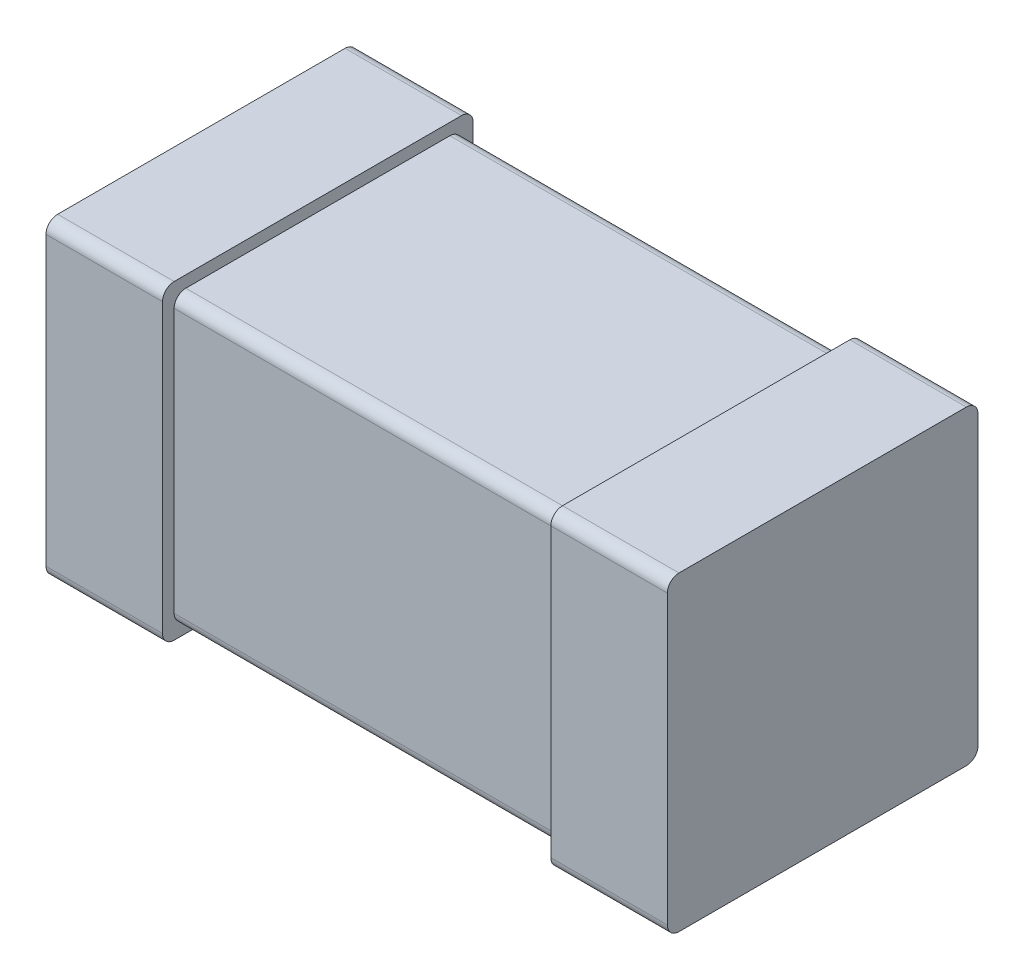
ISO-10303-21;
HEADER;
FILE_DESCRIPTION(('STEP AP214'),'2;1');
FILE_NAME('part.step','',(''),(''),'','','');
FILE_SCHEMA(('AUTOMOTIVE_DESIGN { 1 0 10303 214 1 1 1 1 }'));
ENDSEC;
DATA;
#1=APPLICATION_CONTEXT('core data for automotive mechanical design processes');
#2=APPLICATION_PROTOCOL_DEFINITION('international standard','automotive_design',2000,#1);
#3=PRODUCT_CONTEXT('',#1,'mechanical');
#4=PRODUCT('Part','Part','',(#3));
#5=PRODUCT_RELATED_PRODUCT_CATEGORY('part','',(#4));
#6=PRODUCT_DEFINITION_FORMATION('','',#4);
#7=PRODUCT_DEFINITION_CONTEXT('part definition',#1,'design');
#8=PRODUCT_DEFINITION('design','',#6,#7);
#9=PRODUCT_DEFINITION_SHAPE('','',#8);
#10=(LENGTH_UNIT() NAMED_UNIT(*) SI_UNIT(.MILLI.,.METRE.));
#11=(NAMED_UNIT(*) PLANE_ANGLE_UNIT() SI_UNIT($,.RADIAN.));
#12=(NAMED_UNIT(*) SI_UNIT($,.STERADIAN.) SOLID_ANGLE_UNIT());
#13=UNCERTAINTY_MEASURE_WITH_UNIT(LENGTH_MEASURE(1.E-05),#10,'distance_accuracy_value','');
#14=(GEOMETRIC_REPRESENTATION_CONTEXT(3) GLOBAL_UNCERTAINTY_ASSIGNED_CONTEXT((#13)) GLOBAL_UNIT_ASSIGNED_CONTEXT((#10,
#11,#12)) REPRESENTATION_CONTEXT('',''));
#15=CARTESIAN_POINT('',(0.,0.,0.));
#16=DIRECTION('',(0.,0.,1.));
#17=DIRECTION('',(1.,0.,0.));
#18=AXIS2_PLACEMENT_3D('',#15,#16,#17);
#19=CARTESIAN_POINT('',(-0.8,-0.4,0.));
#20=DIRECTION('',(1.,0.,0.));
#21=DIRECTION('',(0.,0.,-1.));
#22=AXIS2_PLACEMENT_3D('',#19,#20,#21);
#23=PLANE('',#22);
#24=DIRECTION('',(0.,1.,0.));
#25=VECTOR('',#24,1.);
#26=CARTESIAN_POINT('',(-0.8,-0.4,0.8));
#27=LINE('',#26,#25);
#28=CARTESIAN_POINT('',(-0.8,0.37,0.8));
#29=VERTEX_POINT('',#28);
#30=CARTESIAN_POINT('',(-0.8,-0.37,0.8));
#31=VERTEX_POINT('',#30);
#32=EDGE_CURVE('E300',#29,#31,#27,.F.);
#33=ORIENTED_EDGE('',*,*,#32,.F.);
#34=CARTESIAN_POINT('',(-0.8,0.37,0.77));
#35=DIRECTION('',(1.,0.,0.));
#36=DIRECTION('',(0.,0.,-1.));
#37=AXIS2_PLACEMENT_3D('',#34,#35,#36);
#38=CIRCLE('',#37,0.03);
#39=CARTESIAN_POINT('',(-0.8,0.4,0.77));
#40=VERTEX_POINT('',#39);
#41=EDGE_CURVE('E279',#40,#29,#38,.T.);
#42=ORIENTED_EDGE('',*,*,#41,.F.);
#43=DIRECTION('',(0.,0.,1.));
#44=VECTOR('',#43,1.);
#45=CARTESIAN_POINT('',(-0.8,0.4,0.));
#46=LINE('',#45,#44);
#47=CARTESIAN_POINT('',(-0.8,0.4,0.03));
#48=VERTEX_POINT('',#47);
#49=EDGE_CURVE('E201',#48,#40,#46,.T.);
#50=ORIENTED_EDGE('',*,*,#49,.F.);
#51=CARTESIAN_POINT('',(-0.8,0.37,0.03));
#52=DIRECTION('',(1.,0.,0.));
#53=DIRECTION('',(0.,0.,-1.));
#54=AXIS2_PLACEMENT_3D('',#51,#52,#53);
#55=CIRCLE('',#54,0.03);
#56=CARTESIAN_POINT('',(-0.8,0.37,0.));
#57=VERTEX_POINT('',#56);
#58=EDGE_CURVE('E196',#57,#48,#55,.T.);
#59=ORIENTED_EDGE('',*,*,#58,.F.);
#60=DIRECTION('',(0.,1.,0.));
#61=VECTOR('',#60,1.);
#62=CARTESIAN_POINT('',(-0.8,-0.4,0.));
#63=LINE('',#62,#61);
#64=CARTESIAN_POINT('',(-0.8,-0.37,0.));
#65=VERTEX_POINT('',#64);
#66=EDGE_CURVE('E188',#57,#65,#63,.F.);
#67=ORIENTED_EDGE('',*,*,#66,.T.);
#68=CARTESIAN_POINT('',(-0.8,-0.37,0.03));
#69=DIRECTION('',(1.,0.,0.));
#70=DIRECTION('',(0.,0.,-1.));
#71=AXIS2_PLACEMENT_3D('',#68,#69,#70);
#72=CIRCLE('',#71,0.03);
#73=CARTESIAN_POINT('',(-0.8,-0.4,0.03));
#74=VERTEX_POINT('',#73);
#75=EDGE_CURVE('E20',#74,#65,#72,.T.);
#76=ORIENTED_EDGE('',*,*,#75,.F.);
#77=DIRECTION('',(0.,0.,1.));
#78=VECTOR('',#77,1.);
#79=CARTESIAN_POINT('',(-0.8,-0.4,0.));
#80=LINE('',#79,#78);
#81=CARTESIAN_POINT('',(-0.8,-0.4,0.77));
#82=VERTEX_POINT('',#81);
#83=EDGE_CURVE('E171',#74,#82,#80,.T.);
#84=ORIENTED_EDGE('',*,*,#83,.T.);
#85=CARTESIAN_POINT('',(-0.8,-0.37,0.77));
#86=DIRECTION('',(1.,0.,0.));
#87=DIRECTION('',(0.,0.,-1.));
#88=AXIS2_PLACEMENT_3D('',#85,#86,#87);
#89=CIRCLE('',#88,0.03);
#90=EDGE_CURVE('E275',#31,#82,#89,.T.);
#91=ORIENTED_EDGE('',*,*,#90,.F.);
#92=EDGE_LOOP('',(#33,#42,#50,#59,#67,#76,#84,#91));
#93=FACE_BOUND('',#92,.T.);
#94=ADVANCED_FACE('F17',(#93),#23,.F.);
#95=CARTESIAN_POINT('',(0.8,-0.4,0.));
#96=DIRECTION('',(1.,0.,0.));
#97=DIRECTION('',(0.,0.,-1.));
#98=AXIS2_PLACEMENT_3D('',#95,#96,#97);
#99=PLANE('',#98);
#100=DIRECTION('',(0.,1.,0.));
#101=VECTOR('',#100,1.);
#102=CARTESIAN_POINT('',(0.8,-0.4,0.8));
#103=LINE('',#102,#101);
#104=CARTESIAN_POINT('',(0.8,-0.37,0.8));
#105=VERTEX_POINT('',#104);
#106=CARTESIAN_POINT('',(0.8,0.37,0.8));
#107=VERTEX_POINT('',#106);
#108=EDGE_CURVE('E290',#105,#107,#103,.T.);
#109=ORIENTED_EDGE('',*,*,#108,.F.);
#110=CARTESIAN_POINT('',(0.8,-0.37,0.77));
#111=DIRECTION('',(1.,0.,0.));
#112=DIRECTION('',(0.,0.,-1.));
#113=AXIS2_PLACEMENT_3D('',#110,#111,#112);
#114=CIRCLE('',#113,0.03);
#115=CARTESIAN_POINT('',(0.8,-0.4,0.77));
#116=VERTEX_POINT('',#115);
#117=EDGE_CURVE('E259',#116,#105,#114,.F.);
#118=ORIENTED_EDGE('',*,*,#117,.F.);
#119=DIRECTION('',(0.,0.,1.));
#120=VECTOR('',#119,1.);
#121=CARTESIAN_POINT('',(0.8,-0.4,0.));
#122=LINE('',#121,#120);
#123=CARTESIAN_POINT('',(0.8,-0.4,0.03));
#124=VERTEX_POINT('',#123);
#125=EDGE_CURVE('E274',#116,#124,#122,.F.);
#126=ORIENTED_EDGE('',*,*,#125,.T.);
#127=CARTESIAN_POINT('',(0.8,-0.37,0.03));
#128=DIRECTION('',(1.,0.,0.));
#129=DIRECTION('',(0.,0.,-1.));
#130=AXIS2_PLACEMENT_3D('',#127,#128,#129);
#131=CIRCLE('',#130,0.03);
#132=CARTESIAN_POINT('',(0.8,-0.37,0.));
#133=VERTEX_POINT('',#132);
#134=EDGE_CURVE('E271',#133,#124,#131,.F.);
#135=ORIENTED_EDGE('',*,*,#134,.F.);
#136=DIRECTION('',(0.,1.,0.));
#137=VECTOR('',#136,1.);
#138=CARTESIAN_POINT('',(0.8,-0.4,0.));
#139=LINE('',#138,#137);
#140=CARTESIAN_POINT('',(0.8,0.37,0.));
#141=VERTEX_POINT('',#140);
#142=EDGE_CURVE('E270',#133,#141,#139,.T.);
#143=ORIENTED_EDGE('',*,*,#142,.T.);
#144=CARTESIAN_POINT('',(0.8,0.37,0.03));
#145=DIRECTION('',(1.,0.,0.));
#146=DIRECTION('',(0.,0.,-1.));
#147=AXIS2_PLACEMENT_3D('',#144,#145,#146);
#148=CIRCLE('',#147,0.03);
#149=CARTESIAN_POINT('',(0.8,0.4,0.03));
#150=VERTEX_POINT('',#149);
#151=EDGE_CURVE('E267',#150,#141,#148,.F.);
#152=ORIENTED_EDGE('',*,*,#151,.F.);
#153=DIRECTION('',(0.,0.,1.));
#154=VECTOR('',#153,1.);
#155=CARTESIAN_POINT('',(0.8,0.4,0.));
#156=LINE('',#155,#154);
#157=CARTESIAN_POINT('',(0.8,0.4,0.77));
#158=VERTEX_POINT('',#157);
#159=EDGE_CURVE('E295',#158,#150,#156,.F.);
#160=ORIENTED_EDGE('',*,*,#159,.F.);
#161=CARTESIAN_POINT('',(0.8,0.37,0.77));
#162=DIRECTION('',(1.,0.,0.));
#163=DIRECTION('',(0.,0.,-1.));
#164=AXIS2_PLACEMENT_3D('',#161,#162,#163);
#165=CIRCLE('',#164,0.03);
#166=EDGE_CURVE('E263',#107,#158,#165,.F.);
#167=ORIENTED_EDGE('',*,*,#166,.F.);
#168=EDGE_LOOP('',(#109,#118,#126,#135,#143,#152,#160,#167));
#169=FACE_BOUND('',#168,.T.);
#170=ADVANCED_FACE('F444',(#169),#99,.T.);
#171=CARTESIAN_POINT('',(-0.8,-0.4,0.));
#172=DIRECTION('',(0.,1.,0.));
#173=DIRECTION('',(0.,0.,1.));
#174=AXIS2_PLACEMENT_3D('',#171,#172,#173);
#175=PLANE('',#174);
#176=ORIENTED_EDGE('',*,*,#83,.F.);
#177=DIRECTION('',(1.,0.,0.));
#178=VECTOR('',#177,1.);
#179=CARTESIAN_POINT('',(-0.8,-0.4,0.03));
#180=LINE('',#179,#178);
#181=CARTESIAN_POINT('',(-0.5,-0.4,0.03));
#182=VERTEX_POINT('',#181);
#183=EDGE_CURVE('E182',#182,#74,#180,.F.);
#184=ORIENTED_EDGE('',*,*,#183,.F.);
#185=DIRECTION('',(0.,0.,-1.));
#186=VECTOR('',#185,1.);
#187=CARTESIAN_POINT('',(-0.5,-0.4,0.));
#188=LINE('',#187,#186);
#189=CARTESIAN_POINT('',(-0.5,-0.4,0.77));
#190=VERTEX_POINT('',#189);
#191=EDGE_CURVE('E258',#190,#182,#188,.T.);
#192=ORIENTED_EDGE('',*,*,#191,.F.);
#193=DIRECTION('',(1.,0.,0.));
#194=VECTOR('',#193,1.);
#195=CARTESIAN_POINT('',(-0.8,-0.4,0.77));
#196=LINE('',#195,#194);
#197=EDGE_CURVE('E307',#82,#190,#196,.T.);
#198=ORIENTED_EDGE('',*,*,#197,.F.);
#199=EDGE_LOOP('',(#176,#184,#192,#198));
#200=FACE_BOUND('',#199,.T.);
#201=ADVANCED_FACE('F310',(#200),#175,.F.);
#202=CARTESIAN_POINT('',(-0.8,-0.37,0.03));
#203=DIRECTION('',(1.,0.,0.));
#204=DIRECTION('',(0.,0.,-1.));
#205=AXIS2_PLACEMENT_3D('',#202,#203,#204);
#206=CYLINDRICAL_SURFACE('',#205,0.03);
#207=CARTESIAN_POINT('',(-0.5,-0.37,0.03));
#208=DIRECTION('',(1.,0.,0.));
#209=DIRECTION('',(0.,0.,-1.));
#210=AXIS2_PLACEMENT_3D('',#207,#208,#209);
#211=CIRCLE('',#210,0.03);
#212=CARTESIAN_POINT('',(-0.5,-0.37,0.));
#213=VERTEX_POINT('',#212);
#214=EDGE_CURVE('E256',#182,#213,#211,.T.);
#215=ORIENTED_EDGE('',*,*,#214,.F.);
#216=ORIENTED_EDGE('',*,*,#183,.T.);
#217=ORIENTED_EDGE('',*,*,#75,.T.);
#218=DIRECTION('',(1.,0.,0.));
#219=VECTOR('',#218,1.);
#220=CARTESIAN_POINT('',(-0.8,-0.37,0.));
#221=LINE('',#220,#219);
#222=EDGE_CURVE('E180',#65,#213,#221,.T.);
#223=ORIENTED_EDGE('',*,*,#222,.T.);
#224=EDGE_LOOP('',(#215,#216,#217,#223));
#225=FACE_BOUND('',#224,.T.);
#226=ADVANCED_FACE('F179',(#225),#206,.T.);
#227=CARTESIAN_POINT('',(-0.8,-0.4,0.));
#228=DIRECTION('',(0.,0.,1.));
#229=DIRECTION('',(1.,0.,0.));
#230=AXIS2_PLACEMENT_3D('',#227,#228,#229);
#231=PLANE('',#230);
#232=DIRECTION('',(0.,1.,0.));
#233=VECTOR('',#232,1.);
#234=CARTESIAN_POINT('',(-0.5,-0.4,0.));
#235=LINE('',#234,#233);
#236=CARTESIAN_POINT('',(-0.5,0.37,0.));
#237=VERTEX_POINT('',#236);
#238=EDGE_CURVE('E190',#213,#237,#235,.T.);
#239=ORIENTED_EDGE('',*,*,#238,.F.);
#240=ORIENTED_EDGE('',*,*,#222,.F.);
#241=ORIENTED_EDGE('',*,*,#66,.F.);
#242=DIRECTION('',(1.,0.,0.));
#243=VECTOR('',#242,1.);
#244=CARTESIAN_POINT('',(-0.8,0.37,0.));
#245=LINE('',#244,#243);
#246=EDGE_CURVE('E191',#237,#57,#245,.F.);
#247=ORIENTED_EDGE('',*,*,#246,.F.);
#248=EDGE_LOOP('',(#239,#240,#241,#247));
#249=FACE_BOUND('',#248,.T.);
#250=ADVANCED_FACE('F186',(#249),#231,.F.);
#251=CARTESIAN_POINT('',(-0.8,0.37,0.03));
#252=DIRECTION('',(1.,0.,0.));
#253=DIRECTION('',(0.,0.,-1.));
#254=AXIS2_PLACEMENT_3D('',#251,#252,#253);
#255=CYLINDRICAL_SURFACE('',#254,0.03);
#256=ORIENTED_EDGE('',*,*,#246,.T.);
#257=ORIENTED_EDGE('',*,*,#58,.T.);
#258=DIRECTION('',(1.,0.,0.));
#259=VECTOR('',#258,1.);
#260=CARTESIAN_POINT('',(-0.8,0.4,0.03));
#261=LINE('',#260,#259);
#262=CARTESIAN_POINT('',(-0.5,0.4,0.03));
#263=VERTEX_POINT('',#262);
#264=EDGE_CURVE('E281',#263,#48,#261,.F.);
#265=ORIENTED_EDGE('',*,*,#264,.F.);
#266=CARTESIAN_POINT('',(-0.5,0.37,0.03));
#267=DIRECTION('',(1.,0.,0.));
#268=DIRECTION('',(0.,0.,-1.));
#269=AXIS2_PLACEMENT_3D('',#266,#267,#268);
#270=CIRCLE('',#269,0.03);
#271=EDGE_CURVE('E254',#237,#263,#270,.T.);
#272=ORIENTED_EDGE('',*,*,#271,.F.);
#273=EDGE_LOOP('',(#256,#257,#265,#272));
#274=FACE_BOUND('',#273,.T.);
#275=ADVANCED_FACE('F674',(#274),#255,.T.);
#276=CARTESIAN_POINT('',(-0.8,0.4,0.));
#277=DIRECTION('',(0.,1.,0.));
#278=DIRECTION('',(0.,0.,1.));
#279=AXIS2_PLACEMENT_3D('',#276,#277,#278);
#280=PLANE('',#279);
#281=ORIENTED_EDGE('',*,*,#49,.T.);
#282=DIRECTION('',(1.,0.,0.));
#283=VECTOR('',#282,1.);
#284=CARTESIAN_POINT('',(-0.8,0.4,0.77));
#285=LINE('',#284,#283);
#286=CARTESIAN_POINT('',(-0.5,0.4,0.77));
#287=VERTEX_POINT('',#286);
#288=EDGE_CURVE('E280',#287,#40,#285,.F.);
#289=ORIENTED_EDGE('',*,*,#288,.F.);
#290=DIRECTION('',(0.,0.,-1.));
#291=VECTOR('',#290,1.);
#292=CARTESIAN_POINT('',(-0.5,0.4,0.));
#293=LINE('',#292,#291);
#294=EDGE_CURVE('E253',#263,#287,#293,.F.);
#295=ORIENTED_EDGE('',*,*,#294,.F.);
#296=ORIENTED_EDGE('',*,*,#264,.T.);
#297=EDGE_LOOP('',(#281,#289,#295,#296));
#298=FACE_BOUND('',#297,.T.);
#299=ADVANCED_FACE('F666',(#298),#280,.T.);
#300=CARTESIAN_POINT('',(-0.8,0.37,0.77));
#301=DIRECTION('',(1.,0.,0.));
#302=DIRECTION('',(0.,0.,-1.));
#303=AXIS2_PLACEMENT_3D('',#300,#301,#302);
#304=CYLINDRICAL_SURFACE('',#303,0.03);
#305=CARTESIAN_POINT('',(-0.5,0.37,0.77));
#306=DIRECTION('',(1.,0.,0.));
#307=DIRECTION('',(0.,0.,-1.));
#308=AXIS2_PLACEMENT_3D('',#305,#306,#307);
#309=CIRCLE('',#308,0.03);
#310=CARTESIAN_POINT('',(-0.5,0.37,0.8));
#311=VERTEX_POINT('',#310);
#312=EDGE_CURVE('E251',#287,#311,#309,.T.);
#313=ORIENTED_EDGE('',*,*,#312,.F.);
#314=ORIENTED_EDGE('',*,*,#288,.T.);
#315=ORIENTED_EDGE('',*,*,#41,.T.);
#316=DIRECTION('',(1.,0.,0.));
#317=VECTOR('',#316,1.);
#318=CARTESIAN_POINT('',(-0.8,0.37,0.8));
#319=LINE('',#318,#317);
#320=EDGE_CURVE('E301',#311,#29,#319,.F.);
#321=ORIENTED_EDGE('',*,*,#320,.F.);
#322=EDGE_LOOP('',(#313,#314,#315,#321));
#323=FACE_BOUND('',#322,.T.);
#324=ADVANCED_FACE('F322',(#323),#304,.T.);
#325=CARTESIAN_POINT('',(-0.8,-0.4,0.8));
#326=DIRECTION('',(0.,0.,1.));
#327=DIRECTION('',(1.,0.,0.));
#328=AXIS2_PLACEMENT_3D('',#325,#326,#327);
#329=PLANE('',#328);
#330=DIRECTION('',(0.,1.,0.));
#331=VECTOR('',#330,1.);
#332=CARTESIAN_POINT('',(-0.5,-0.4,0.8));
#333=LINE('',#332,#331);
#334=CARTESIAN_POINT('',(-0.5,-0.37,0.8));
#335=VERTEX_POINT('',#334);
#336=EDGE_CURVE('E250',#311,#335,#333,.F.);
#337=ORIENTED_EDGE('',*,*,#336,.F.);
#338=ORIENTED_EDGE('',*,*,#320,.T.);
#339=ORIENTED_EDGE('',*,*,#32,.T.);
#340=DIRECTION('',(1.,0.,0.));
#341=VECTOR('',#340,1.);
#342=CARTESIAN_POINT('',(-0.8,-0.37,0.8));
#343=LINE('',#342,#341);
#344=EDGE_CURVE('E278',#335,#31,#343,.F.);
#345=ORIENTED_EDGE('',*,*,#344,.F.);
#346=EDGE_LOOP('',(#337,#338,#339,#345));
#347=FACE_BOUND('',#346,.T.);
#348=ADVANCED_FACE('F328',(#347),#329,.T.);
#349=CARTESIAN_POINT('',(-0.8,-0.37,0.77));
#350=DIRECTION('',(1.,0.,0.));
#351=DIRECTION('',(0.,0.,-1.));
#352=AXIS2_PLACEMENT_3D('',#349,#350,#351);
#353=CYLINDRICAL_SURFACE('',#352,0.03);
#354=ORIENTED_EDGE('',*,*,#344,.T.);
#355=ORIENTED_EDGE('',*,*,#90,.T.);
#356=ORIENTED_EDGE('',*,*,#197,.T.);
#357=CARTESIAN_POINT('',(-0.5,-0.37,0.77));
#358=DIRECTION('',(1.,0.,0.));
#359=DIRECTION('',(0.,0.,-1.));
#360=AXIS2_PLACEMENT_3D('',#357,#358,#359);
#361=CIRCLE('',#360,0.03);
#362=EDGE_CURVE('E247',#335,#190,#361,.T.);
#363=ORIENTED_EDGE('',*,*,#362,.F.);
#364=EDGE_LOOP('',(#354,#355,#356,#363));
#365=FACE_BOUND('',#364,.T.);
#366=ADVANCED_FACE('F305',(#365),#353,.T.);
#367=CARTESIAN_POINT('',(0.5,-0.4,0.));
#368=DIRECTION('',(0.,1.,0.));
#369=DIRECTION('',(0.,0.,1.));
#370=AXIS2_PLACEMENT_3D('',#367,#368,#369);
#371=PLANE('',#370);
#372=DIRECTION('',(0.,0.,-1.));
#373=VECTOR('',#372,1.);
#374=CARTESIAN_POINT('',(0.5,-0.4,0.));
#375=LINE('',#374,#373);
#376=CARTESIAN_POINT('',(0.5,-0.4,0.77));
#377=VERTEX_POINT('',#376);
#378=CARTESIAN_POINT('',(0.5,-0.4,0.03));
#379=VERTEX_POINT('',#378);
#380=EDGE_CURVE('E236',#377,#379,#375,.T.);
#381=ORIENTED_EDGE('',*,*,#380,.T.);
#382=DIRECTION('',(1.,0.,0.));
#383=VECTOR('',#382,1.);
#384=CARTESIAN_POINT('',(0.5,-0.4,0.03));
#385=LINE('',#384,#383);
#386=EDGE_CURVE('E273',#124,#379,#385,.F.);
#387=ORIENTED_EDGE('',*,*,#386,.F.);
#388=ORIENTED_EDGE('',*,*,#125,.F.);
#389=DIRECTION('',(1.,0.,0.));
#390=VECTOR('',#389,1.);
#391=CARTESIAN_POINT('',(0.5,-0.4,0.77));
#392=LINE('',#391,#390);
#393=EDGE_CURVE('E262',#377,#116,#392,.T.);
#394=ORIENTED_EDGE('',*,*,#393,.F.);
#395=EDGE_LOOP('',(#381,#387,#388,#394));
#396=FACE_BOUND('',#395,.T.);
#397=ADVANCED_FACE('F369',(#396),#371,.F.);
#398=CARTESIAN_POINT('',(0.5,-0.37,0.03));
#399=DIRECTION('',(1.,0.,0.));
#400=DIRECTION('',(0.,0.,-1.));
#401=AXIS2_PLACEMENT_3D('',#398,#399,#400);
#402=CYLINDRICAL_SURFACE('',#401,0.03);
#403=ORIENTED_EDGE('',*,*,#134,.T.);
#404=ORIENTED_EDGE('',*,*,#386,.T.);
#405=CARTESIAN_POINT('',(0.5,-0.37,0.03));
#406=DIRECTION('',(1.,0.,0.));
#407=DIRECTION('',(0.,0.,-1.));
#408=AXIS2_PLACEMENT_3D('',#405,#406,#407);
#409=CIRCLE('',#408,0.03);
#410=CARTESIAN_POINT('',(0.5,-0.37,0.));
#411=VERTEX_POINT('',#410);
#412=EDGE_CURVE('E233',#379,#411,#409,.T.);
#413=ORIENTED_EDGE('',*,*,#412,.T.);
#414=DIRECTION('',(1.,0.,0.));
#415=VECTOR('',#414,1.);
#416=CARTESIAN_POINT('',(0.5,-0.37,0.));
#417=LINE('',#416,#415);
#418=EDGE_CURVE('E299',#411,#133,#417,.T.);
#419=ORIENTED_EDGE('',*,*,#418,.T.);
#420=EDGE_LOOP('',(#403,#404,#413,#419));
#421=FACE_BOUND('',#420,.T.);
#422=ADVANCED_FACE('F358',(#421),#402,.T.);
#423=CARTESIAN_POINT('',(0.5,-0.4,0.));
#424=DIRECTION('',(0.,0.,1.));
#425=DIRECTION('',(1.,0.,0.));
#426=AXIS2_PLACEMENT_3D('',#423,#424,#425);
#427=PLANE('',#426);
#428=ORIENTED_EDGE('',*,*,#142,.F.);
#429=ORIENTED_EDGE('',*,*,#418,.F.);
#430=DIRECTION('',(0.,1.,0.));
#431=VECTOR('',#430,1.);
#432=CARTESIAN_POINT('',(0.5,-0.4,0.));
#433=LINE('',#432,#431);
#434=CARTESIAN_POINT('',(0.5,0.37,0.));
#435=VERTEX_POINT('',#434);
#436=EDGE_CURVE('E232',#411,#435,#433,.T.);
#437=ORIENTED_EDGE('',*,*,#436,.T.);
#438=DIRECTION('',(1.,0.,0.));
#439=VECTOR('',#438,1.);
#440=CARTESIAN_POINT('',(0.5,0.37,0.));
#441=LINE('',#440,#439);
#442=EDGE_CURVE('E269',#141,#435,#441,.F.);
#443=ORIENTED_EDGE('',*,*,#442,.F.);
#444=EDGE_LOOP('',(#428,#429,#437,#443));
#445=FACE_BOUND('',#444,.T.);
#446=ADVANCED_FACE('F441',(#445),#427,.F.);
#447=CARTESIAN_POINT('',(0.5,0.37,0.03));
#448=DIRECTION('',(1.,0.,0.));
#449=DIRECTION('',(0.,0.,-1.));
#450=AXIS2_PLACEMENT_3D('',#447,#448,#449);
#451=CYLINDRICAL_SURFACE('',#450,0.03);
#452=ORIENTED_EDGE('',*,*,#442,.T.);
#453=CARTESIAN_POINT('',(0.5,0.37,0.03));
#454=DIRECTION('',(1.,0.,0.));
#455=DIRECTION('',(0.,0.,-1.));
#456=AXIS2_PLACEMENT_3D('',#453,#454,#455);
#457=CIRCLE('',#456,0.03);
#458=CARTESIAN_POINT('',(0.5,0.4,0.03));
#459=VERTEX_POINT('',#458);
#460=EDGE_CURVE('E229',#435,#459,#457,.T.);
#461=ORIENTED_EDGE('',*,*,#460,.T.);
#462=DIRECTION('',(1.,0.,0.));
#463=VECTOR('',#462,1.);
#464=CARTESIAN_POINT('',(0.5,0.4,0.03));
#465=LINE('',#464,#463);
#466=EDGE_CURVE('E266',#150,#459,#465,.F.);
#467=ORIENTED_EDGE('',*,*,#466,.F.);
#468=ORIENTED_EDGE('',*,*,#151,.T.);
#469=EDGE_LOOP('',(#452,#461,#467,#468));
#470=FACE_BOUND('',#469,.T.);
#471=ADVANCED_FACE('F436',(#470),#451,.T.);
#472=CARTESIAN_POINT('',(0.5,0.4,0.));
#473=DIRECTION('',(0.,1.,0.));
#474=DIRECTION('',(0.,0.,1.));
#475=AXIS2_PLACEMENT_3D('',#472,#473,#474);
#476=PLANE('',#475);
#477=DIRECTION('',(0.,0.,-1.));
#478=VECTOR('',#477,1.);
#479=CARTESIAN_POINT('',(0.5,0.4,0.));
#480=LINE('',#479,#478);
#481=CARTESIAN_POINT('',(0.5,0.4,0.77));
#482=VERTEX_POINT('',#481);
#483=EDGE_CURVE('E228',#459,#482,#480,.F.);
#484=ORIENTED_EDGE('',*,*,#483,.T.);
#485=DIRECTION('',(1.,0.,0.));
#486=VECTOR('',#485,1.);
#487=CARTESIAN_POINT('',(0.5,0.4,0.77));
#488=LINE('',#487,#486);
#489=EDGE_CURVE('E265',#158,#482,#488,.F.);
#490=ORIENTED_EDGE('',*,*,#489,.F.);
#491=ORIENTED_EDGE('',*,*,#159,.T.);
#492=ORIENTED_EDGE('',*,*,#466,.T.);
#493=EDGE_LOOP('',(#484,#490,#491,#492));
#494=FACE_BOUND('',#493,.T.);
#495=ADVANCED_FACE('F432',(#494),#476,.T.);
#496=CARTESIAN_POINT('',(0.5,0.37,0.77));
#497=DIRECTION('',(1.,0.,0.));
#498=DIRECTION('',(0.,0.,-1.));
#499=AXIS2_PLACEMENT_3D('',#496,#497,#498);
#500=CYLINDRICAL_SURFACE('',#499,0.03);
#501=ORIENTED_EDGE('',*,*,#166,.T.);
#502=ORIENTED_EDGE('',*,*,#489,.T.);
#503=CARTESIAN_POINT('',(0.5,0.37,0.77));
#504=DIRECTION('',(1.,0.,0.));
#505=DIRECTION('',(0.,0.,-1.));
#506=AXIS2_PLACEMENT_3D('',#503,#504,#505);
#507=CIRCLE('',#506,0.03);
#508=CARTESIAN_POINT('',(0.5,0.37,0.8));
#509=VERTEX_POINT('',#508);
#510=EDGE_CURVE('E225',#482,#509,#507,.T.);
#511=ORIENTED_EDGE('',*,*,#510,.T.);
#512=DIRECTION('',(1.,0.,0.));
#513=VECTOR('',#512,1.);
#514=CARTESIAN_POINT('',(0.5,0.37,0.8));
#515=LINE('',#514,#513);
#516=EDGE_CURVE('E292',#107,#509,#515,.F.);
#517=ORIENTED_EDGE('',*,*,#516,.F.);
#518=EDGE_LOOP('',(#501,#502,#511,#517));
#519=FACE_BOUND('',#518,.T.);
#520=ADVANCED_FACE('F455',(#519),#500,.T.);
#521=CARTESIAN_POINT('',(0.5,-0.4,0.8));
#522=DIRECTION('',(0.,0.,1.));
#523=DIRECTION('',(1.,0.,0.));
#524=AXIS2_PLACEMENT_3D('',#521,#522,#523);
#525=PLANE('',#524);
#526=ORIENTED_EDGE('',*,*,#108,.T.);
#527=ORIENTED_EDGE('',*,*,#516,.T.);
#528=DIRECTION('',(0.,1.,0.));
#529=VECTOR('',#528,1.);
#530=CARTESIAN_POINT('',(0.5,-0.4,0.8));
#531=LINE('',#530,#529);
#532=CARTESIAN_POINT('',(0.5,-0.37,0.8));
#533=VERTEX_POINT('',#532);
#534=EDGE_CURVE('E224',#509,#533,#531,.F.);
#535=ORIENTED_EDGE('',*,*,#534,.T.);
#536=DIRECTION('',(1.,0.,0.));
#537=VECTOR('',#536,1.);
#538=CARTESIAN_POINT('',(0.5,-0.37,0.8));
#539=LINE('',#538,#537);
#540=EDGE_CURVE('E261',#105,#533,#539,.F.);
#541=ORIENTED_EDGE('',*,*,#540,.F.);
#542=EDGE_LOOP('',(#526,#527,#535,#541));
#543=FACE_BOUND('',#542,.T.);
#544=ADVANCED_FACE('F451',(#543),#525,.T.);
#545=CARTESIAN_POINT('',(0.5,-0.37,0.77));
#546=DIRECTION('',(1.,0.,0.));
#547=DIRECTION('',(0.,0.,-1.));
#548=AXIS2_PLACEMENT_3D('',#545,#546,#547);
#549=CYLINDRICAL_SURFACE('',#548,0.03);
#550=ORIENTED_EDGE('',*,*,#540,.T.);
#551=CARTESIAN_POINT('',(0.5,-0.37,0.77));
#552=DIRECTION('',(1.,0.,0.));
#553=DIRECTION('',(0.,0.,-1.));
#554=AXIS2_PLACEMENT_3D('',#551,#552,#553);
#555=CIRCLE('',#554,0.03);
#556=EDGE_CURVE('E221',#533,#377,#555,.T.);
#557=ORIENTED_EDGE('',*,*,#556,.T.);
#558=ORIENTED_EDGE('',*,*,#393,.T.);
#559=ORIENTED_EDGE('',*,*,#117,.T.);
#560=EDGE_LOOP('',(#550,#557,#558,#559));
#561=FACE_BOUND('',#560,.T.);
#562=ADVANCED_FACE('F448',(#561),#549,.T.);
#563=CARTESIAN_POINT('',(-0.5,-0.37,0.03));
#564=DIRECTION('',(0.,1.,0.));
#565=DIRECTION('',(0.,0.,1.));
#566=AXIS2_PLACEMENT_3D('',#563,#564,#565);
#567=PLANE('',#566);
#568=DIRECTION('',(0.,0.,-1.));
#569=VECTOR('',#568,1.);
#570=CARTESIAN_POINT('',(-0.5,-0.37,0.));
#571=LINE('',#570,#569);
#572=CARTESIAN_POINT('',(-0.5,-0.37,0.06));
#573=VERTEX_POINT('',#572);
#574=CARTESIAN_POINT('',(-0.5,-0.37,0.74));
#575=VERTEX_POINT('',#574);
#576=EDGE_CURVE('E246',#573,#575,#571,.F.);
#577=ORIENTED_EDGE('',*,*,#576,.F.);
#578=DIRECTION('',(1.,0.,0.));
#579=VECTOR('',#578,1.);
#580=CARTESIAN_POINT('',(-0.5,-0.37,0.06));
#581=LINE('',#580,#579);
#582=CARTESIAN_POINT('',(0.5,-0.37,0.06));
#583=VERTEX_POINT('',#582);
#584=EDGE_CURVE('E239',#583,#573,#581,.F.);
#585=ORIENTED_EDGE('',*,*,#584,.F.);
#586=DIRECTION('',(0.,0.,-1.));
#587=VECTOR('',#586,1.);
#588=CARTESIAN_POINT('',(0.5,-0.37,0.));
#589=LINE('',#588,#587);
#590=CARTESIAN_POINT('',(0.5,-0.37,0.74));
#591=VERTEX_POINT('',#590);
#592=EDGE_CURVE('E217',#583,#591,#589,.F.);
#593=ORIENTED_EDGE('',*,*,#592,.T.);
#594=DIRECTION('',(1.,0.,0.));
#595=VECTOR('',#594,1.);
#596=CARTESIAN_POINT('',(-0.5,-0.37,0.74));
#597=LINE('',#596,#595);
#598=EDGE_CURVE('E344',#575,#591,#597,.T.);
#599=ORIENTED_EDGE('',*,*,#598,.F.);
#600=EDGE_LOOP('',(#577,#585,#593,#599));
#601=FACE_BOUND('',#600,.T.);
#602=ADVANCED_FACE('F420',(#601),#567,.F.);
#603=CARTESIAN_POINT('',(-0.5,-0.34,0.74));
#604=DIRECTION('',(1.,0.,0.));
#605=DIRECTION('',(0.,0.,-1.));
#606=AXIS2_PLACEMENT_3D('',#603,#604,#605);
#607=CYLINDRICAL_SURFACE('',#606,0.03);
#608=DIRECTION('',(1.,0.,0.));
#609=VECTOR('',#608,1.);
#610=CARTESIAN_POINT('',(-0.5,-0.34,0.77));
#611=LINE('',#610,#609);
#612=CARTESIAN_POINT('',(-0.5,-0.34,0.77));
#613=VERTEX_POINT('',#612);
#614=CARTESIAN_POINT('',(0.5,-0.34,0.77));
#615=VERTEX_POINT('',#614);
#616=EDGE_CURVE('E342',#613,#615,#611,.T.);
#617=ORIENTED_EDGE('',*,*,#616,.F.);
#618=CARTESIAN_POINT('',(-0.5,-0.34,0.74));
#619=DIRECTION('',(1.,0.,0.));
#620=DIRECTION('',(0.,0.,-1.));
#621=AXIS2_PLACEMENT_3D('',#618,#619,#620);
#622=CIRCLE('',#621,0.03);
#623=EDGE_CURVE('E244',#575,#613,#622,.F.);
#624=ORIENTED_EDGE('',*,*,#623,.F.);
#625=ORIENTED_EDGE('',*,*,#598,.T.);
#626=CARTESIAN_POINT('',(0.5,-0.34,0.74));
#627=DIRECTION('',(1.,0.,0.));
#628=DIRECTION('',(0.,0.,-1.));
#629=AXIS2_PLACEMENT_3D('',#626,#627,#628);
#630=CIRCLE('',#629,0.03);
#631=EDGE_CURVE('E214',#591,#615,#630,.F.);
#632=ORIENTED_EDGE('',*,*,#631,.T.);
#633=EDGE_LOOP('',(#617,#624,#625,#632));
#634=FACE_BOUND('',#633,.T.);
#635=ADVANCED_FACE('F422',(#634),#607,.T.);
#636=CARTESIAN_POINT('',(-0.5,-0.37,0.77));
#637=DIRECTION('',(0.,0.,1.));
#638=DIRECTION('',(1.,0.,0.));
#639=AXIS2_PLACEMENT_3D('',#636,#637,#638);
#640=PLANE('',#639);
#641=DIRECTION('',(0.,1.,0.));
#642=VECTOR('',#641,1.);
#643=CARTESIAN_POINT('',(0.5,-0.4,0.77));
#644=LINE('',#643,#642);
#645=CARTESIAN_POINT('',(0.5,0.34,0.77));
#646=VERTEX_POINT('',#645);
#647=EDGE_CURVE('E213',#615,#646,#644,.T.);
#648=ORIENTED_EDGE('',*,*,#647,.T.);
#649=DIRECTION('',(1.,0.,0.));
#650=VECTOR('',#649,1.);
#651=CARTESIAN_POINT('',(-0.5,0.34,0.77));
#652=LINE('',#651,#650);
#653=CARTESIAN_POINT('',(-0.5,0.34,0.77));
#654=VERTEX_POINT('',#653);
#655=EDGE_CURVE('E340',#654,#646,#652,.T.);
#656=ORIENTED_EDGE('',*,*,#655,.F.);
#657=DIRECTION('',(0.,1.,0.));
#658=VECTOR('',#657,1.);
#659=CARTESIAN_POINT('',(-0.5,-0.4,0.77));
#660=LINE('',#659,#658);
#661=EDGE_CURVE('E243',#613,#654,#660,.T.);
#662=ORIENTED_EDGE('',*,*,#661,.F.);
#663=ORIENTED_EDGE('',*,*,#616,.T.);
#664=EDGE_LOOP('',(#648,#656,#662,#663));
#665=FACE_BOUND('',#664,.T.);
#666=ADVANCED_FACE('F393',(#665),#640,.T.);
#667=CARTESIAN_POINT('',(-0.5,0.34,0.74));
#668=DIRECTION('',(1.,0.,0.));
#669=DIRECTION('',(0.,0.,-1.));
#670=AXIS2_PLACEMENT_3D('',#667,#668,#669);
#671=CYLINDRICAL_SURFACE('',#670,0.03);
#672=CARTESIAN_POINT('',(0.5,0.34,0.74));
#673=DIRECTION('',(1.,0.,0.));
#674=DIRECTION('',(0.,0.,-1.));
#675=AXIS2_PLACEMENT_3D('',#672,#673,#674);
#676=CIRCLE('',#675,0.03);
#677=CARTESIAN_POINT('',(0.5,0.37,0.74));
#678=VERTEX_POINT('',#677);
#679=EDGE_CURVE('E209',#646,#678,#676,.F.);
#680=ORIENTED_EDGE('',*,*,#679,.T.);
#681=DIRECTION('',(1.,0.,0.));
#682=VECTOR('',#681,1.);
#683=CARTESIAN_POINT('',(-0.5,0.37,0.74));
#684=LINE('',#683,#682);
#685=CARTESIAN_POINT('',(-0.5,0.37,0.74));
#686=VERTEX_POINT('',#685);
#687=EDGE_CURVE('E337',#686,#678,#684,.T.);
#688=ORIENTED_EDGE('',*,*,#687,.F.);
#689=CARTESIAN_POINT('',(-0.5,0.34,0.74));
#690=DIRECTION('',(1.,0.,0.));
#691=DIRECTION('',(0.,0.,-1.));
#692=AXIS2_PLACEMENT_3D('',#689,#690,#691);
#693=CIRCLE('',#692,0.03);
#694=EDGE_CURVE('E241',#654,#686,#693,.F.);
#695=ORIENTED_EDGE('',*,*,#694,.F.);
#696=ORIENTED_EDGE('',*,*,#655,.T.);
#697=EDGE_LOOP('',(#680,#688,#695,#696));
#698=FACE_BOUND('',#697,.T.);
#699=ADVANCED_FACE('F397',(#698),#671,.T.);
#700=CARTESIAN_POINT('',(-0.5,0.37,0.03));
#701=DIRECTION('',(0.,1.,0.));
#702=DIRECTION('',(0.,0.,1.));
#703=AXIS2_PLACEMENT_3D('',#700,#701,#702);
#704=PLANE('',#703);
#705=DIRECTION('',(0.,0.,-1.));
#706=VECTOR('',#705,1.);
#707=CARTESIAN_POINT('',(-0.5,0.37,0.));
#708=LINE('',#707,#706);
#709=CARTESIAN_POINT('',(-0.5,0.37,0.06));
#710=VERTEX_POINT('',#709);
#711=EDGE_CURVE('E240',#686,#710,#708,.T.);
#712=ORIENTED_EDGE('',*,*,#711,.F.);
#713=ORIENTED_EDGE('',*,*,#687,.T.);
#714=DIRECTION('',(0.,0.,-1.));
#715=VECTOR('',#714,1.);
#716=CARTESIAN_POINT('',(0.5,0.37,0.));
#717=LINE('',#716,#715);
#718=CARTESIAN_POINT('',(0.5,0.37,0.06));
#719=VERTEX_POINT('',#718);
#720=EDGE_CURVE('E212',#678,#719,#717,.T.);
#721=ORIENTED_EDGE('',*,*,#720,.T.);
#722=DIRECTION('',(1.,0.,0.));
#723=VECTOR('',#722,1.);
#724=CARTESIAN_POINT('',(-0.5,0.37,0.06));
#725=LINE('',#724,#723);
#726=EDGE_CURVE('E208',#710,#719,#725,.T.);
#727=ORIENTED_EDGE('',*,*,#726,.F.);
#728=EDGE_LOOP('',(#712,#713,#721,#727));
#729=FACE_BOUND('',#728,.T.);
#730=ADVANCED_FACE('F403',(#729),#704,.T.);
#731=CARTESIAN_POINT('',(-0.5,-0.4,0.));
#732=DIRECTION('',(1.,0.,0.));
#733=DIRECTION('',(0.,0.,-1.));
#734=AXIS2_PLACEMENT_3D('',#731,#732,#733);
#735=PLANE('',#734);
#736=CARTESIAN_POINT('',(-0.5,0.34,0.06));
#737=DIRECTION('',(1.,0.,0.));
#738=DIRECTION('',(0.,0.,-1.));
#739=AXIS2_PLACEMENT_3D('',#736,#737,#738);
#740=CIRCLE('',#739,0.03);
#741=CARTESIAN_POINT('',(-0.5,0.34,0.03));
#742=VERTEX_POINT('',#741);
#743=EDGE_CURVE('E203',#742,#710,#740,.T.);
#744=ORIENTED_EDGE('',*,*,#743,.F.);
#745=DIRECTION('',(0.,1.,0.));
#746=VECTOR('',#745,1.);
#747=CARTESIAN_POINT('',(-0.5,-0.37,0.03));
#748=LINE('',#747,#746);
#749=CARTESIAN_POINT('',(-0.5,-0.34,0.03));
#750=VERTEX_POINT('',#749);
#751=EDGE_CURVE('E206',#742,#750,#748,.F.);
#752=ORIENTED_EDGE('',*,*,#751,.T.);
#753=CARTESIAN_POINT('',(-0.5,-0.34,0.06));
#754=DIRECTION('',(1.,0.,0.));
#755=DIRECTION('',(0.,0.,-1.));
#756=AXIS2_PLACEMENT_3D('',#753,#754,#755);
#757=CIRCLE('',#756,0.03);
#758=EDGE_CURVE('E237',#573,#750,#757,.T.);
#759=ORIENTED_EDGE('',*,*,#758,.F.);
#760=ORIENTED_EDGE('',*,*,#576,.T.);
#761=ORIENTED_EDGE('',*,*,#623,.T.);
#762=ORIENTED_EDGE('',*,*,#661,.T.);
#763=ORIENTED_EDGE('',*,*,#694,.T.);
#764=ORIENTED_EDGE('',*,*,#711,.T.);
#765=EDGE_LOOP('',(#744,#752,#759,#760,#761,#762,#763,#764));
#766=FACE_BOUND('',#765,.T.);
#767=ORIENTED_EDGE('',*,*,#336,.T.);
#768=ORIENTED_EDGE('',*,*,#362,.T.);
#769=ORIENTED_EDGE('',*,*,#191,.T.);
#770=ORIENTED_EDGE('',*,*,#214,.T.);
#771=ORIENTED_EDGE('',*,*,#238,.T.);
#772=ORIENTED_EDGE('',*,*,#271,.T.);
#773=ORIENTED_EDGE('',*,*,#294,.T.);
#774=ORIENTED_EDGE('',*,*,#312,.T.);
#775=EDGE_LOOP('',(#767,#768,#769,#770,#771,#772,#773,#774));
#776=FACE_BOUND('',#775,.T.);
#777=ADVANCED_FACE('F386',(#766,#776),#735,.T.);
#778=CARTESIAN_POINT('',(-0.5,-0.34,0.06));
#779=DIRECTION('',(1.,0.,0.));
#780=DIRECTION('',(0.,0.,-1.));
#781=AXIS2_PLACEMENT_3D('',#778,#779,#780);
#782=CYLINDRICAL_SURFACE('',#781,0.03);
#783=CARTESIAN_POINT('',(0.5,-0.34,0.06));
#784=DIRECTION('',(1.,0.,0.));
#785=DIRECTION('',(0.,0.,-1.));
#786=AXIS2_PLACEMENT_3D('',#783,#784,#785);
#787=CIRCLE('',#786,0.03);
#788=CARTESIAN_POINT('',(0.5,-0.34,0.03));
#789=VERTEX_POINT('',#788);
#790=EDGE_CURVE('E218',#789,#583,#787,.F.);
#791=ORIENTED_EDGE('',*,*,#790,.T.);
#792=ORIENTED_EDGE('',*,*,#584,.T.);
#793=ORIENTED_EDGE('',*,*,#758,.T.);
#794=DIRECTION('',(1.,0.,0.));
#795=VECTOR('',#794,1.);
#796=CARTESIAN_POINT('',(-0.5,-0.34,0.03));
#797=LINE('',#796,#795);
#798=EDGE_CURVE('E374',#750,#789,#797,.T.);
#799=ORIENTED_EDGE('',*,*,#798,.T.);
#800=EDGE_LOOP('',(#791,#792,#793,#799));
#801=FACE_BOUND('',#800,.T.);
#802=ADVANCED_FACE('F416',(#801),#782,.T.);
#803=CARTESIAN_POINT('',(0.5,-0.4,0.));
#804=DIRECTION('',(1.,0.,0.));
#805=DIRECTION('',(0.,0.,-1.));
#806=AXIS2_PLACEMENT_3D('',#803,#804,#805);
#807=PLANE('',#806);
#808=CARTESIAN_POINT('',(0.5,0.34,0.06));
#809=DIRECTION('',(1.,0.,0.));
#810=DIRECTION('',(0.,0.,-1.));
#811=AXIS2_PLACEMENT_3D('',#808,#809,#810);
#812=CIRCLE('',#811,0.03);
#813=CARTESIAN_POINT('',(0.5,0.34,0.03));
#814=VERTEX_POINT('',#813);
#815=EDGE_CURVE('E34',#719,#814,#812,.F.);
#816=ORIENTED_EDGE('',*,*,#815,.F.);
#817=ORIENTED_EDGE('',*,*,#720,.F.);
#818=ORIENTED_EDGE('',*,*,#679,.F.);
#819=ORIENTED_EDGE('',*,*,#647,.F.);
#820=ORIENTED_EDGE('',*,*,#631,.F.);
#821=ORIENTED_EDGE('',*,*,#592,.F.);
#822=ORIENTED_EDGE('',*,*,#790,.F.);
#823=DIRECTION('',(0.,1.,0.));
#824=VECTOR('',#823,1.);
#825=CARTESIAN_POINT('',(0.5,-0.37,0.03));
#826=LINE('',#825,#824);
#827=EDGE_CURVE('E26',#789,#814,#826,.T.);
#828=ORIENTED_EDGE('',*,*,#827,.T.);
#829=EDGE_LOOP('',(#816,#817,#818,#819,#820,#821,#822,#828));
#830=FACE_BOUND('',#829,.T.);
#831=ORIENTED_EDGE('',*,*,#534,.F.);
#832=ORIENTED_EDGE('',*,*,#510,.F.);
#833=ORIENTED_EDGE('',*,*,#483,.F.);
#834=ORIENTED_EDGE('',*,*,#460,.F.);
#835=ORIENTED_EDGE('',*,*,#436,.F.);
#836=ORIENTED_EDGE('',*,*,#412,.F.);
#837=ORIENTED_EDGE('',*,*,#380,.F.);
#838=ORIENTED_EDGE('',*,*,#556,.F.);
#839=EDGE_LOOP('',(#831,#832,#833,#834,#835,#836,#837,#838));
#840=FACE_BOUND('',#839,.T.);
#841=ADVANCED_FACE('F364',(#830,#840),#807,.F.);
#842=CARTESIAN_POINT('',(-0.5,0.34,0.06));
#843=DIRECTION('',(1.,0.,0.));
#844=DIRECTION('',(0.,0.,-1.));
#845=AXIS2_PLACEMENT_3D('',#842,#843,#844);
#846=CYLINDRICAL_SURFACE('',#845,0.03);
#847=DIRECTION('',(1.,0.,0.));
#848=VECTOR('',#847,1.);
#849=CARTESIAN_POINT('',(-0.5,0.34,0.03));
#850=LINE('',#849,#848);
#851=EDGE_CURVE('E11',#814,#742,#850,.F.);
#852=ORIENTED_EDGE('',*,*,#851,.T.);
#853=ORIENTED_EDGE('',*,*,#743,.T.);
#854=ORIENTED_EDGE('',*,*,#726,.T.);
#855=ORIENTED_EDGE('',*,*,#815,.T.);
#856=EDGE_LOOP('',(#852,#853,#854,#855));
#857=FACE_BOUND('',#856,.T.);
#858=ADVANCED_FACE('F404',(#857),#846,.T.);
#859=CARTESIAN_POINT('',(-0.5,-0.37,0.03));
#860=DIRECTION('',(0.,0.,1.));
#861=DIRECTION('',(1.,0.,0.));
#862=AXIS2_PLACEMENT_3D('',#859,#860,#861);
#863=PLANE('',#862);
#864=ORIENTED_EDGE('',*,*,#827,.F.);
#865=ORIENTED_EDGE('',*,*,#798,.F.);
#866=ORIENTED_EDGE('',*,*,#751,.F.);
#867=ORIENTED_EDGE('',*,*,#851,.F.);
#868=EDGE_LOOP('',(#864,#865,#866,#867));
#869=FACE_BOUND('',#868,.T.);
#870=ADVANCED_FACE('F409',(#869),#863,.F.);
#871=CLOSED_SHELL('',(#94,#170,#201,#226,#250,#275,#299,#324,#348,#366,#397,#422,#446,#471,#495,
#520,#544,#562,#602,#635,#666,#699,#730,#777,#802,#841,#858,#870));
#872=MANIFOLD_SOLID_BREP('B1',#871);
#873=ADVANCED_BREP_SHAPE_REPRESENTATION('',(#18,#872),#14);
#874=SHAPE_DEFINITION_REPRESENTATION(#9,#873);
ENDSEC;
END-ISO-10303-21;
